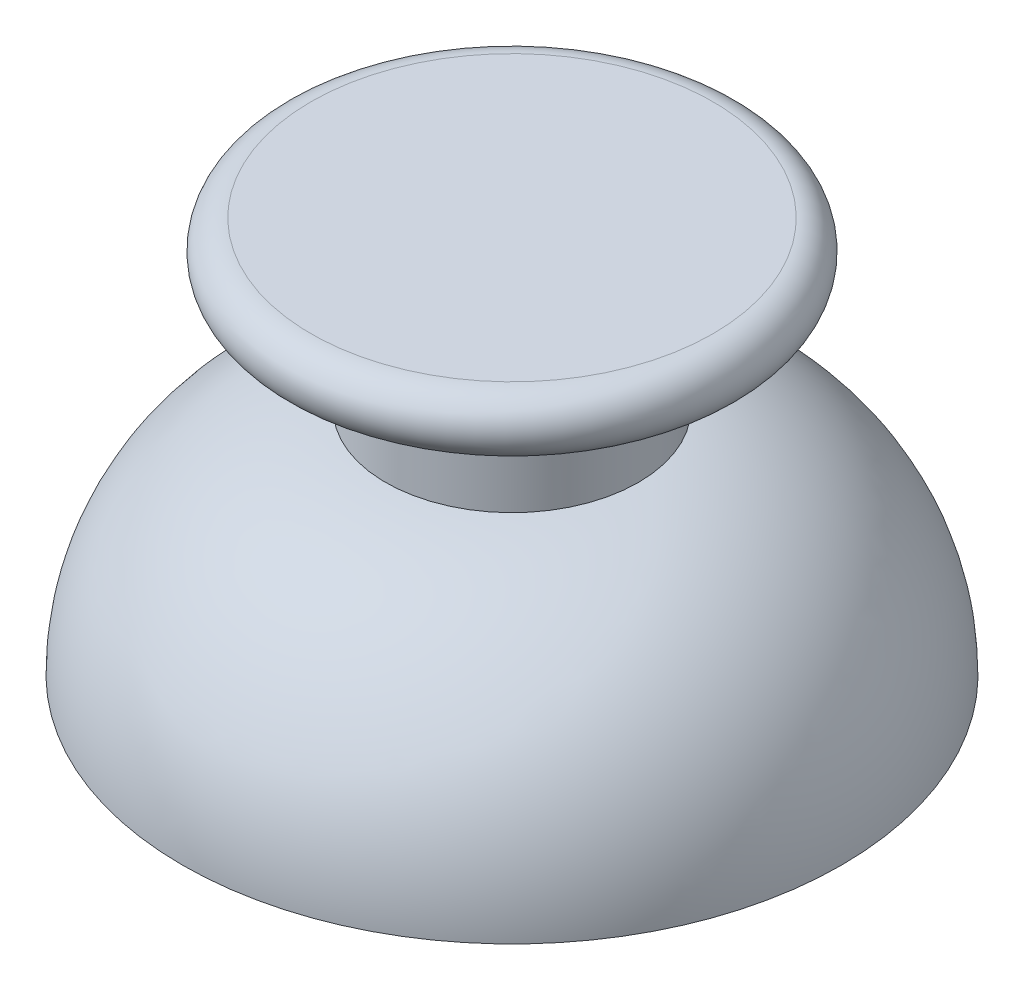
ISO-10303-21;
HEADER;
FILE_DESCRIPTION(('STEP AP214'),'2;1');
FILE_NAME('part.step','',(''),(''),'','','');
FILE_SCHEMA(('AUTOMOTIVE_DESIGN { 1 0 10303 214 1 1 1 1 }'));
ENDSEC;
DATA;
#1=APPLICATION_CONTEXT('core data for automotive mechanical design processes');
#2=APPLICATION_PROTOCOL_DEFINITION('international standard','automotive_design',2000,#1);
#3=PRODUCT_CONTEXT('',#1,'mechanical');
#4=PRODUCT('Part','Part','',(#3));
#5=PRODUCT_RELATED_PRODUCT_CATEGORY('part','',(#4));
#6=PRODUCT_DEFINITION_FORMATION('','',#4);
#7=PRODUCT_DEFINITION_CONTEXT('part definition',#1,'design');
#8=PRODUCT_DEFINITION('design','',#6,#7);
#9=PRODUCT_DEFINITION_SHAPE('','',#8);
#10=(LENGTH_UNIT() NAMED_UNIT(*) SI_UNIT(.MILLI.,.METRE.));
#11=(NAMED_UNIT(*) PLANE_ANGLE_UNIT() SI_UNIT($,.RADIAN.));
#12=(NAMED_UNIT(*) SI_UNIT($,.STERADIAN.) SOLID_ANGLE_UNIT());
#13=UNCERTAINTY_MEASURE_WITH_UNIT(LENGTH_MEASURE(1.E-05),#10,'distance_accuracy_value','');
#14=(GEOMETRIC_REPRESENTATION_CONTEXT(3) GLOBAL_UNCERTAINTY_ASSIGNED_CONTEXT((#13)) GLOBAL_UNIT_ASSIGNED_CONTEXT((#10,
#11,#12)) REPRESENTATION_CONTEXT('',''));
#15=CARTESIAN_POINT('',(0.,0.,0.));
#16=DIRECTION('',(0.,0.,1.));
#17=DIRECTION('',(1.,0.,0.));
#18=AXIS2_PLACEMENT_3D('',#15,#16,#17);
#19=CARTESIAN_POINT('',(0.,29.,0.));
#20=DIRECTION('',(0.,-1.,0.));
#21=DIRECTION('',(0.,0.,-1.));
#22=AXIS2_PLACEMENT_3D('',#19,#20,#21);
#23=PLANE('',#22);
#24=CARTESIAN_POINT('',(0.,29.,0.));
#25=DIRECTION('',(0.,-1.,0.));
#26=DIRECTION('',(1.,0.,0.));
#27=AXIS2_PLACEMENT_3D('',#24,#25,#26);
#28=CIRCLE('',#27,7.868575362039);
#29=CARTESIAN_POINT('',(7.868575362039,29.,0.));
#30=VERTEX_POINT('',#29);
#31=EDGE_CURVE('E64',#30,#30,#28,.T.);
#32=ORIENTED_EDGE('',*,*,#31,.F.);
#33=EDGE_LOOP('',(#32));
#34=FACE_BOUND('',#33,.T.);
#35=ADVANCED_FACE('F15',(#34),#23,.F.);
#36=CARTESIAN_POINT('',(0.,27.868575313329,0.));
#37=DIRECTION('',(0.,1.,0.));
#38=DIRECTION('',(1.,0.,0.));
#39=AXIS2_PLACEMENT_3D('',#36,#37,#38);
#40=TOROIDAL_SURFACE('',#39,7.868575313329,1.131424686671);
#41=ORIENTED_EDGE('',*,*,#31,.T.);
#42=EDGE_LOOP('',(#41));
#43=FACE_BOUND('',#42,.T.);
#44=CARTESIAN_POINT('',(0.,26.7446524254832,0.));
#45=DIRECTION('',(0.,1.,0.));
#46=DIRECTION('',(1.,0.,0.));
#47=AXIS2_PLACEMENT_3D('',#44,#45,#46);
#48=CIRCLE('',#47,7.99864899930897);
#49=CARTESIAN_POINT('',(7.99864899930897,26.7446524254832,0.));
#50=VERTEX_POINT('',#49);
#51=EDGE_CURVE('E41',#50,#50,#48,.T.);
#52=ORIENTED_EDGE('',*,*,#51,.T.);
#53=EDGE_LOOP('',(#52));
#54=FACE_BOUND('',#53,.T.);
#55=ADVANCED_FACE('F53',(#43,#54),#40,.T.);
#56=CARTESIAN_POINT('',(0.,10.132777777778,0.));
#57=DIRECTION('',(1.,0.,0.));
#58=DIRECTION('',(0.,0.,-1.));
#59=AXIS2_PLACEMENT_3D('',#56,#57,#58);
#60=SPHERICAL_SURFACE('',#59,12.367222222222);
#61=CARTESIAN_POINT('',(11.8999999999998,13.5,0.));
#62=CARTESIAN_POINT('',(11.8999971579055,13.5,-0.415231014121698));
#63=CARTESIAN_POINT('',(11.8782448866467,13.5,-0.830520183745632));
#64=CARTESIAN_POINT('',(11.7914508442826,13.5,-1.65654716661474));
#65=CARTESIAN_POINT('',(11.7264094078184,13.5,-2.06728501501835));
#66=CARTESIAN_POINT('',(11.5706168900217,13.5,-2.80047453454715));
#67=CARTESIAN_POINT('',(11.4873433693788,13.5,-3.12453639239246));
#68=CARTESIAN_POINT('',(11.2937832086656,13.5,-3.76460519633997));
#69=CARTESIAN_POINT('',(11.1834894034112,13.5,-4.08060998130338));
#70=CARTESIAN_POINT('',(10.9365516923727,13.5,-4.70254332916056));
#71=CARTESIAN_POINT('',(10.7998792483506,13.5,-5.00846055510207));
#72=CARTESIAN_POINT('',(10.5012341725676,13.5,-5.60768596948302));
#73=CARTESIAN_POINT('',(10.3392616297292,13.5,-5.90099420223483));
#74=CARTESIAN_POINT('',(9.99125439131833,13.5,-6.4727731441928));
#75=CARTESIAN_POINT('',(9.80523150764217,13.5,-6.75125104288048));
#76=CARTESIAN_POINT('',(9.41038156886256,13.5,-7.29154832527713));
#77=CARTESIAN_POINT('',(9.20155415039217,13.5,-7.55336744344023));
#78=CARTESIAN_POINT('',(8.76263925037714,13.5,-8.05841514110384));
#79=CARTESIAN_POINT('',(8.53255725886732,13.5,-8.30164849179515));
#80=CARTESIAN_POINT('',(8.05272388119943,13.5,-8.76786964742301));
#81=CARTESIAN_POINT('',(7.80297257272183,13.5,-8.99085753230791));
#82=CARTESIAN_POINT('',(7.28554709177726,13.5,-9.41502669897255));
#83=CARTESIAN_POINT('',(7.01787099722881,13.5,-9.61620563609386));
#84=CARTESIAN_POINT('',(6.46652257353655,13.5,-9.99529940632662));
#85=CARTESIAN_POINT('',(6.18285022802323,13.5,-10.1732142156305));
#86=CARTESIAN_POINT('',(5.60151475251886,13.5,-10.5045212020967));
#87=CARTESIAN_POINT('',(5.30385107234872,13.5,-10.6579124138758));
#88=CARTESIAN_POINT('',(4.6966596353299,13.5,-10.93907315323));
#89=CARTESIAN_POINT('',(4.38713188082731,13.5,-11.0668426858718));
#90=CARTESIAN_POINT('',(3.75841878846285,13.5,-11.2958495557625));
#91=CARTESIAN_POINT('',(3.43923363199886,13.5,-11.3970873910197));
#92=CARTESIAN_POINT('',(2.79346940480919,13.5,-11.5723142741334));
#93=CARTESIAN_POINT('',(2.46689033394584,13.5,-11.6463033214826));
#94=CARTESIAN_POINT('',(1.80866074831649,13.5,-11.7665064830443));
#95=CARTESIAN_POINT('',(1.47701024396536,13.5,-11.8127206542884));
#96=CARTESIAN_POINT('',(0.810994967252682,13.5,-11.8770457471266));
#97=CARTESIAN_POINT('',(0.476630194894325,13.5,-11.8951566687538));
#98=CARTESIAN_POINT('',(-0.192437137196012,13.5,-11.9031465124804));
#99=CARTESIAN_POINT('',(-0.527139697579911,13.5,-11.8930253799884));
#100=CARTESIAN_POINT('',(-1.19450242050706,13.5,-11.8446229537746));
#101=CARTESIAN_POINT('',(-1.52716258305088,13.5,-11.8063416600606));
#102=CARTESIAN_POINT('',(-2.18807488949177,13.5,-11.7018911642629));
#103=CARTESIAN_POINT('',(-2.5163270414125,13.5,-11.635722012949));
#104=CARTESIAN_POINT('',(-3.1660902726557,13.5,-11.4759662306422));
#105=CARTESIAN_POINT('',(-3.48760135198646,13.5,-11.382379599683));
#106=CARTESIAN_POINT('',(-4.12159681086828,13.5,-11.1684541613643));
#107=CARTESIAN_POINT('',(-4.43408118701933,13.5,-11.0481153439285));
#108=CARTESIAN_POINT('',(-5.0478015392247,13.5,-10.7815410886846));
#109=CARTESIAN_POINT('',(-5.34903751526399,13.5,-10.6353056508419));
#110=CARTESIAN_POINT('',(-5.93811977643801,13.5,-10.3179776306002));
#111=CARTESIAN_POINT('',(-6.22596604728699,13.5,-10.1468850216814));
#112=CARTESIAN_POINT('',(-6.78622213828907,13.5,-9.7810591428161));
#113=CARTESIAN_POINT('',(-7.05863195843419,13.5,-9.58632587285742));
#114=CARTESIAN_POINT('',(-7.58607838843078,13.5,-9.17460317813605));
#115=CARTESIAN_POINT('',(-7.84111500399825,13.5,-8.95761376069596));
#116=CARTESIAN_POINT('',(-8.33200196469403,13.5,-8.50292138337027));
#117=CARTESIAN_POINT('',(-8.56785230983652,13.5,-8.26521842349996));
#118=CARTESIAN_POINT('',(-9.01868988220788,13.5,-7.77078898880272));
#119=CARTESIAN_POINT('',(-9.23367711797279,13.5,-7.51406252175922));
#120=CARTESIAN_POINT('',(-9.64126015117893,13.5,-6.98341115767065));
#121=CARTESIAN_POINT('',(-9.8338559486228,13.5,-6.7094862606276));
#122=CARTESIAN_POINT('',(-10.1952868900859,13.5,-6.14638543858401));
#123=CARTESIAN_POINT('',(-10.364122030813,13.5,-5.85720951147042));
#124=CARTESIAN_POINT('',(-10.6768313106855,13.5,-5.26566253135453));
#125=CARTESIAN_POINT('',(-10.8207054498247,13.5,-4.96329147834889));
#126=CARTESIAN_POINT('',(-11.082469885009,13.5,-4.34750388249546));
#127=CARTESIAN_POINT('',(-11.2003601776193,13.5,-4.03408733818756));
#128=CARTESIAN_POINT('',(-11.4093187660838,13.5,-3.3984370016881));
#129=CARTESIAN_POINT('',(-11.500387061937,13.5,-3.07620320949622));
#130=CARTESIAN_POINT('',(-11.6550542124499,13.5,-2.42520928080125));
#131=CARTESIAN_POINT('',(-11.7186530682954,13.5,-2.0964491445799));
#132=CARTESIAN_POINT('',(-11.817929194714,13.5,-1.43473980204513));
#133=CARTESIAN_POINT('',(-11.8536064652893,13.5,-1.10179059573204));
#134=CARTESIAN_POINT('',(-11.8967857761626,13.5,-0.434070197818257));
#135=CARTESIAN_POINT('',(-11.9042878177539,13.5,-0.0992990063011843));
#136=CARTESIAN_POINT('',(-11.891063339214,13.5,0.569685354701427));
#137=CARTESIAN_POINT('',(-11.8703368190836,13.5,0.903898524186982));
#138=CARTESIAN_POINT('',(-11.800802570258,13.5,1.56939078568849));
#139=CARTESIAN_POINT('',(-11.7519948415762,13.5,1.90066987770584));
#140=CARTESIAN_POINT('',(-11.6266451693428,13.5,2.55793878868633));
#141=CARTESIAN_POINT('',(-11.5501032257904,13.5,2.88392860764931));
#142=CARTESIAN_POINT('',(-11.3698292869262,13.5,3.52830139543861));
#143=CARTESIAN_POINT('',(-11.2660972903403,13.5,3.84668436390852));
#144=CARTESIAN_POINT('',(-11.032180719453,13.5,4.47357992264765));
#145=CARTESIAN_POINT('',(-10.9019961451493,13.5,4.78209251291607));
#146=CARTESIAN_POINT('',(-10.6160999467952,13.5,5.38705398901947));
#147=CARTESIAN_POINT('',(-10.4603883216012,13.5,5.68350287431405));
#148=CARTESIAN_POINT('',(-10.1245450420907,13.5,6.26222935157058));
#149=CARTESIAN_POINT('',(-9.94441338777512,13.5,6.54450694353304));
#150=CARTESIAN_POINT('',(-9.56101070452271,13.5,7.09288397187272));
#151=CARTESIAN_POINT('',(-9.35773967874196,13.5,7.35898341045654));
#152=CARTESIAN_POINT('',(-8.92950336774403,13.5,7.87311236651791));
#153=CARTESIAN_POINT('',(-8.70453808253252,13.5,8.1211418840002));
#154=CARTESIAN_POINT('',(-8.23451265432391,13.5,8.59736762295608));
#155=CARTESIAN_POINT('',(-7.98945251418895,13.5,8.82556384725457));
#156=CARTESIAN_POINT('',(-7.48097957838718,13.5,9.26050070170588));
#157=CARTESIAN_POINT('',(-7.21756678271812,13.5,9.46724133185606));
#158=CARTESIAN_POINT('',(-6.67426112769623,13.5,9.85779727890529));
#159=CARTESIAN_POINT('',(-6.39436826140359,13.5,10.0416125861503));
#160=CARTESIAN_POINT('',(-5.82009243701197,13.5,10.3850109685891));
#161=CARTESIAN_POINT('',(-5.52570947890203,13.5,10.5445940437646));
#162=CARTESIAN_POINT('',(-4.92454625747376,13.5,10.8383934707135));
#163=CARTESIAN_POINT('',(-4.61776598999799,13.5,10.9726098139801));
#164=CARTESIAN_POINT('',(-3.99398926877367,13.5,11.2147215118732));
#165=CARTESIAN_POINT('',(-3.67699281503054,13.5,11.3226168665136));
#166=CARTESIAN_POINT('',(-3.0350377292368,13.5,11.5113194120348));
#167=CARTESIAN_POINT('',(-2.71007910587753,13.5,11.592126632483));
#168=CARTESIAN_POINT('',(-2.05450960645525,13.5,11.7260785815227));
#169=CARTESIAN_POINT('',(-1.72389873039992,13.5,11.7792233101516));
#170=CARTESIAN_POINT('',(-1.05937529021537,13.5,11.8574724345194));
#171=CARTESIAN_POINT('',(-0.725462727300102,13.5,11.8825768405677));
#172=CARTESIAN_POINT('',(-0.0567097071761801,13.5,11.9045668778975));
#173=CARTESIAN_POINT('',(0.278130750033625,13.5,11.9014525091442));
#174=CARTESIAN_POINT('',(0.94635965878632,13.5,11.8670271064874));
#175=CARTESIAN_POINT('',(1.27974810767516,13.5,11.8357160210663));
#176=CARTESIAN_POINT('',(1.94270218713642,13.5,11.7451197168299));
#177=CARTESIAN_POINT('',(2.27226781770715,13.5,11.6858344980023));
#178=CARTESIAN_POINT('',(2.92523256082537,13.5,11.5397115626426));
#179=CARTESIAN_POINT('',(3.24863168622524,13.5,11.4528739035428));
#180=CARTESIAN_POINT('',(3.88696495694867,13.5,11.2522634126264));
#181=CARTESIAN_POINT('',(4.20189910227614,13.5,11.1384905808222));
#182=CARTESIAN_POINT('',(4.82106415263647,13.5,10.8848183009167));
#183=CARTESIAN_POINT('',(5.1252950325548,13.5,10.7449187915157));
#184=CARTESIAN_POINT('',(5.72088986565439,13.5,10.4399879383718));
#185=CARTESIAN_POINT('',(6.01225381896508,13.5,10.2749565948817));
#186=CARTESIAN_POINT('',(6.58004898047704,13.5,9.92093185319574));
#187=CARTESIAN_POINT('',(6.85647989399347,13.5,9.7319379823755));
#188=CARTESIAN_POINT('',(7.39243748595833,13.5,9.33133438884867));
#189=CARTESIAN_POINT('',(7.65196416163155,13.5,9.11972466242921));
#190=CARTESIAN_POINT('',(8.15225765672799,13.5,8.67540311784439));
#191=CARTESIAN_POINT('',(8.39302525586062,13.5,8.44269217760881));
#192=CARTESIAN_POINT('',(8.85410073264931,13.5,7.95781528821815));
#193=CARTESIAN_POINT('',(9.07440862842868,13.5,7.70564935629675));
#194=CARTESIAN_POINT('',(9.49297534731703,13.5,7.18368415123825));
#195=CARTESIAN_POINT('',(9.6912366303711,13.5,6.91388685074076));
#196=CARTESIAN_POINT('',(10.0643299199683,13.5,6.35855038871398));
#197=CARTESIAN_POINT('',(10.2391618477222,13.5,6.07301117425171));
#198=CARTESIAN_POINT('',(10.5641966249602,13.5,5.48814258585864));
#199=CARTESIAN_POINT('',(10.7143928613347,13.5,5.18880953669606));
#200=CARTESIAN_POINT('',(10.9890293538496,13.5,4.57855777234338));
#201=CARTESIAN_POINT('',(11.1134699599302,13.5,4.26763921463266));
#202=CARTESIAN_POINT('',(11.3361501064695,13.5,3.63518057256648));
#203=CARTESIAN_POINT('',(11.4342847097078,13.5,3.31360353416064));
#204=CARTESIAN_POINT('',(11.6030026063889,13.5,2.66330144400086));
#205=CARTESIAN_POINT('',(11.6735857675394,13.5,2.33457635793249));
#206=CARTESIAN_POINT('',(11.78663217807,13.5,1.67268880672983));
#207=CARTESIAN_POINT('',(11.8291259137485,13.5,1.33953155405565));
#208=CARTESIAN_POINT('',(11.8858071592509,13.5,0.670928427607354));
#209=CARTESIAN_POINT('',(11.9000022962514,13.5,0.33548319496532));
#210=CARTESIAN_POINT('',(11.8999999999998,13.5,0.));
#211=B_SPLINE_CURVE_WITH_KNOTS('',3,(#61,#62,#63,#64,#65,#66,#67,#68,#69,#70,#71,#72,#73,#74,
#75,#76,#77,#78,#79,#80,#81,#82,#83,#84,#85,#86,#87,#88,#89,#90,#91,#92,#93,#94,#95,#96,#97,#98,
#99,#100,#101,#102,#103,#104,#105,#106,#107,#108,#109,#110,#111,#112,#113,#114,#115,#116,#117,
#118,#119,#120,#121,#122,#123,#124,#125,#126,#127,#128,#129,#130,#131,#132,#133,#134,#135,#136,
#137,#138,#139,#140,#141,#142,#143,#144,#145,#146,#147,#148,#149,#150,#151,#152,#153,#154,#155,
#156,#157,#158,#159,#160,#161,#162,#163,#164,#165,#166,#167,#168,#169,#170,#171,#172,#173,#174,
#175,#176,#177,#178,#179,#180,#181,#182,#183,#184,#185,#186,#187,#188,#189,#190,#191,#192,#193,
#194,#195,#196,#197,#198,#199,#200,#201,#202,#203,#204,#205,#206,#207,#208,#209,#210),
.UNSPECIFIED.,.T.,.F.,(4,2,2,2,2,2,2,2,2,2,2,2,2,2,2,2,2,2,2,2,2,2,2,2,2,2,2,2,2,2,2,2,2,2,2,2,
2,2,2,2,2,2,2,2,2,2,2,2,2,2,2,2,2,2,2,2,2,2,2,2,2,2,2,2,2,2,2,2,2,2,2,2,2,2,4),(0.,
1.24524085784908,2.4904720896422,3.49310320547646,4.49600048532396,5.49998891311425,
6.50397381225355,7.50746748204211,8.51097714381034,9.51422832096807,10.5174755361633,
11.5208305027327,12.5241864960877,13.5275819773166,14.5309772601283,15.5343537075494,
16.5377301736525,17.5411045794647,18.5444789840946,19.5478553289221,20.5512316734701,
21.5546061913812,22.557980708061,23.5613556026687,24.5647304986172,25.5681064650625,
26.5714824320273,27.5748580688678,28.5782337049673,29.5816089305395,30.5849841559937,
31.5883595204668,32.5917348851941,33.5951103825592,34.5984858799601,35.6018613340449,
36.6052367880505,37.6086121960025,38.6119876039264,39.6153630113712,40.6187384188435,
41.6221138733273,42.6254893278928,43.6288648274048,44.6322403268801,45.6356156895007,
46.6389910518592,47.6423662713054,48.6457414908746,49.6491171329712,50.6524927758255,
51.6558687551638,52.6592447339703,53.6626196175625,54.6659944997919,55.6693690131178,
56.6727435276856,57.6761198755007,58.6794962237583,59.6828704805236,60.6862447368248,
61.6896213473214,62.6929979477246,63.6963943412804,64.6997908995655,65.7031457300201,
66.7064996716894,67.7097415472787,68.7129867965251,69.7165009138515,70.720001395594,
71.7274472978992,72.7348980375469,73.7412535574528,74.7473378028126),.UNSPECIFIED.);
#212=CARTESIAN_POINT('',(11.8999999999998,13.5,0.));
#213=VERTEX_POINT('',#212);
#214=EDGE_CURVE('E19',#213,#213,#211,.T.);
#215=ORIENTED_EDGE('',*,*,#214,.F.);
#216=EDGE_LOOP('',(#215));
#217=FACE_BOUND('',#216,.T.);
#218=ADVANCED_FACE('F47',(#217),#60,.F.);
#219=CARTESIAN_POINT('',(2.995277088203,69.977171337464,0.));
#220=DIRECTION('',(0.,0.,1.));
#221=DIRECTION('',(1.,0.,0.));
#222=AXIS2_PLACEMENT_3D('',#219,#220,#221);
#223=CIRCLE('',#222,43.521080202077);
#224=TRIMMED_CURVE('',#223,(PARAMETER_VALUE(-1.63967436804957)),
(PARAMETER_VALUE(1.63967436804957)),.T.,.PARAMETER.);
#225=CARTESIAN_POINT('',(0.,0.,0.));
#226=DIRECTION('',(0.,1.,0.));
#227=AXIS1_PLACEMENT('',#225,#226);
#228=SURFACE_OF_REVOLUTION('',#224,#227);
#229=ORIENTED_EDGE('',*,*,#51,.F.);
#230=EDGE_LOOP('',(#229));
#231=FACE_BOUND('',#230,.T.);
#232=CARTESIAN_POINT('',(0.,26.50001089323,0.));
#233=DIRECTION('',(0.,1.,0.));
#234=DIRECTION('',(0.,0.,1.));
#235=AXIS2_PLACEMENT_3D('',#232,#233,#234);
#236=CIRCLE('',#235,4.95);
#237=CARTESIAN_POINT('',(0.,26.50001089323,4.94999999999999));
#238=VERTEX_POINT('',#237);
#239=EDGE_CURVE('E33',#238,#238,#236,.F.);
#240=ORIENTED_EDGE('',*,*,#239,.F.);
#241=EDGE_LOOP('',(#240));
#242=FACE_BOUND('',#241,.T.);
#243=ADVANCED_FACE('F44',(#231,#242),#228,.T.);
#244=CARTESIAN_POINT('',(0.,13.5,0.));
#245=DIRECTION('',(0.,-1.,0.));
#246=DIRECTION('',(0.,0.,-1.));
#247=AXIS2_PLACEMENT_3D('',#244,#245,#246);
#248=PLANE('',#247);
#249=CARTESIAN_POINT('',(0.,13.5,0.));
#250=DIRECTION('',(0.,1.,0.));
#251=DIRECTION('',(0.,0.,1.));
#252=AXIS2_PLACEMENT_3D('',#249,#250,#251);
#253=CIRCLE('',#252,12.9);
#254=CARTESIAN_POINT('',(0.,13.5,12.9));
#255=VERTEX_POINT('',#254);
#256=EDGE_CURVE('E28',#255,#255,#253,.F.);
#257=ORIENTED_EDGE('',*,*,#256,.T.);
#258=EDGE_LOOP('',(#257));
#259=FACE_BOUND('',#258,.T.);
#260=ORIENTED_EDGE('',*,*,#214,.T.);
#261=EDGE_LOOP('',(#260));
#262=FACE_BOUND('',#261,.T.);
#263=ADVANCED_FACE('F46',(#259,#262),#248,.T.);
#264=CARTESIAN_POINT('',(0.,22.50001089323,0.));
#265=DIRECTION('',(0.,1.,0.));
#266=DIRECTION('',(0.,0.,1.));
#267=AXIS2_PLACEMENT_3D('',#264,#265,#266);
#268=CYLINDRICAL_SURFACE('',#267,4.95);
#269=ORIENTED_EDGE('',*,*,#239,.T.);
#270=EDGE_LOOP('',(#269));
#271=FACE_BOUND('',#270,.T.);
#272=CARTESIAN_POINT('',(0.,22.5000108932226,0.));
#273=DIRECTION('',(0.,1.,0.));
#274=DIRECTION('',(1.,0.,0.));
#275=AXIS2_PLACEMENT_3D('',#272,#273,#274);
#276=CIRCLE('',#275,4.95000000000658);
#277=CARTESIAN_POINT('',(4.95000000000658,22.5000108932226,0.));
#278=VERTEX_POINT('',#277);
#279=EDGE_CURVE('E10',#278,#278,#276,.T.);
#280=ORIENTED_EDGE('',*,*,#279,.T.);
#281=EDGE_LOOP('',(#280));
#282=FACE_BOUND('',#281,.T.);
#283=ADVANCED_FACE('F89',(#271,#282),#268,.T.);
#284=CARTESIAN_POINT('',(3.8306480454,13.5,0.));
#285=DIRECTION('',(0.,0.,1.));
#286=DIRECTION('',(1.,0.,0.));
#287=AXIS2_PLACEMENT_3D('',#284,#285,#286);
#288=CIRCLE('',#287,9.0693519546);
#289=TRIMMED_CURVE('',#288,(PARAMETER_VALUE(-2.00685787653053)),
(PARAMETER_VALUE(2.00685787653053)),.T.,.PARAMETER.);
#290=CARTESIAN_POINT('',(0.,0.,0.));
#291=DIRECTION('',(0.,1.,0.));
#292=AXIS1_PLACEMENT('',#290,#291);
#293=SURFACE_OF_REVOLUTION('',#289,#292);
#294=ORIENTED_EDGE('',*,*,#279,.F.);
#295=EDGE_LOOP('',(#294));
#296=FACE_BOUND('',#295,.T.);
#297=ORIENTED_EDGE('',*,*,#256,.F.);
#298=EDGE_LOOP('',(#297));
#299=FACE_BOUND('',#298,.T.);
#300=ADVANCED_FACE('F95',(#296,#299),#293,.T.);
#301=CLOSED_SHELL('',(#35,#55,#218,#243,#263,#283,#300));
#302=MANIFOLD_SOLID_BREP('B1',#301);
#303=ADVANCED_BREP_SHAPE_REPRESENTATION('',(#18,#302),#14);
#304=SHAPE_DEFINITION_REPRESENTATION(#9,#303);
ENDSEC;
END-ISO-10303-21;
